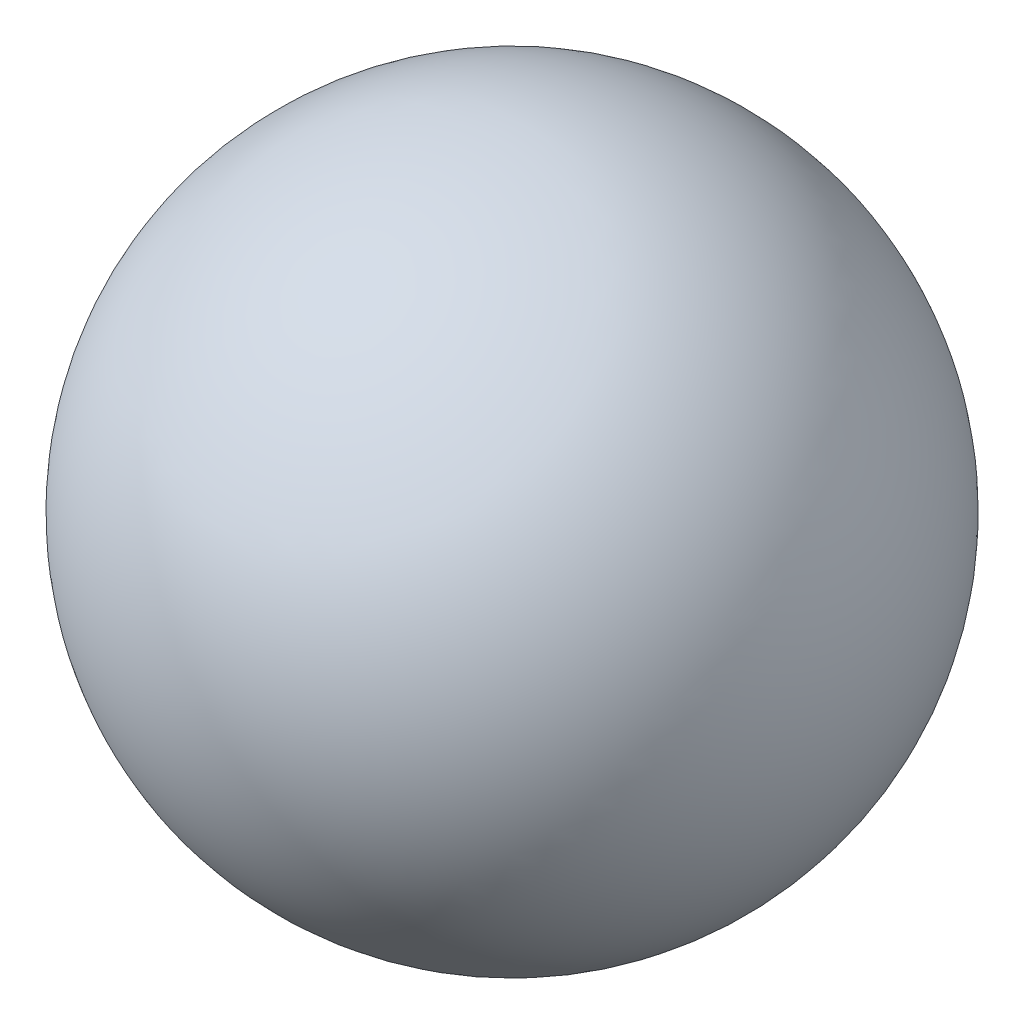
ISO-10303-21;
HEADER;
FILE_DESCRIPTION(('STEP AP214'),'2;1');
FILE_NAME('part.step','',(''),(''),'','','');
FILE_SCHEMA(('AUTOMOTIVE_DESIGN { 1 0 10303 214 1 1 1 1 }'));
ENDSEC;
DATA;
#1=APPLICATION_CONTEXT('core data for automotive mechanical design processes');
#2=APPLICATION_PROTOCOL_DEFINITION('international standard','automotive_design',2000,#1);
#3=PRODUCT_CONTEXT('',#1,'mechanical');
#4=PRODUCT('Part','Part','',(#3));
#5=PRODUCT_RELATED_PRODUCT_CATEGORY('part','',(#4));
#6=PRODUCT_DEFINITION_FORMATION('','',#4);
#7=PRODUCT_DEFINITION_CONTEXT('part definition',#1,'design');
#8=PRODUCT_DEFINITION('design','',#6,#7);
#9=PRODUCT_DEFINITION_SHAPE('','',#8);
#10=(LENGTH_UNIT() NAMED_UNIT(*) SI_UNIT(.MILLI.,.METRE.));
#11=(NAMED_UNIT(*) PLANE_ANGLE_UNIT() SI_UNIT($,.RADIAN.));
#12=(NAMED_UNIT(*) SI_UNIT($,.STERADIAN.) SOLID_ANGLE_UNIT());
#13=UNCERTAINTY_MEASURE_WITH_UNIT(LENGTH_MEASURE(1.E-05),#10,'distance_accuracy_value','');
#14=(GEOMETRIC_REPRESENTATION_CONTEXT(3) GLOBAL_UNCERTAINTY_ASSIGNED_CONTEXT((#13)) GLOBAL_UNIT_ASSIGNED_CONTEXT((#10,
#11,#12)) REPRESENTATION_CONTEXT('',''));
#15=CARTESIAN_POINT('',(0.,0.,0.));
#16=DIRECTION('',(0.,0.,1.));
#17=DIRECTION('',(1.,0.,0.));
#18=AXIS2_PLACEMENT_3D('',#15,#16,#17);
#19=CARTESIAN_POINT('',(81.0484218899887,0.,-46.9552082111022));
#20=DIRECTION('',(0.,0.,1.));
#21=DIRECTION('',(-1.,0.,0.));
#22=AXIS2_PLACEMENT_3D('',#19,#20,#21);
#23=SPHERICAL_SURFACE('',#22,65.);
#24=CARTESIAN_POINT('',(81.0484218899887,0.,18.0447917888978));
#25=VERTEX_POINT('',#24);
#26=VERTEX_LOOP('',#25);
#27=FACE_BOUND('',#26,.T.);
#28=ADVANCED_FACE('F29',(#27),#23,.T.);
#29=CLOSED_SHELL('',(#28));
#30=MANIFOLD_SOLID_BREP('B2',#29);
#31=ADVANCED_BREP_SHAPE_REPRESENTATION('',(#18,#30),#14);
#32=SHAPE_DEFINITION_REPRESENTATION(#9,#31);
ENDSEC;
END-ISO-10303-21;
